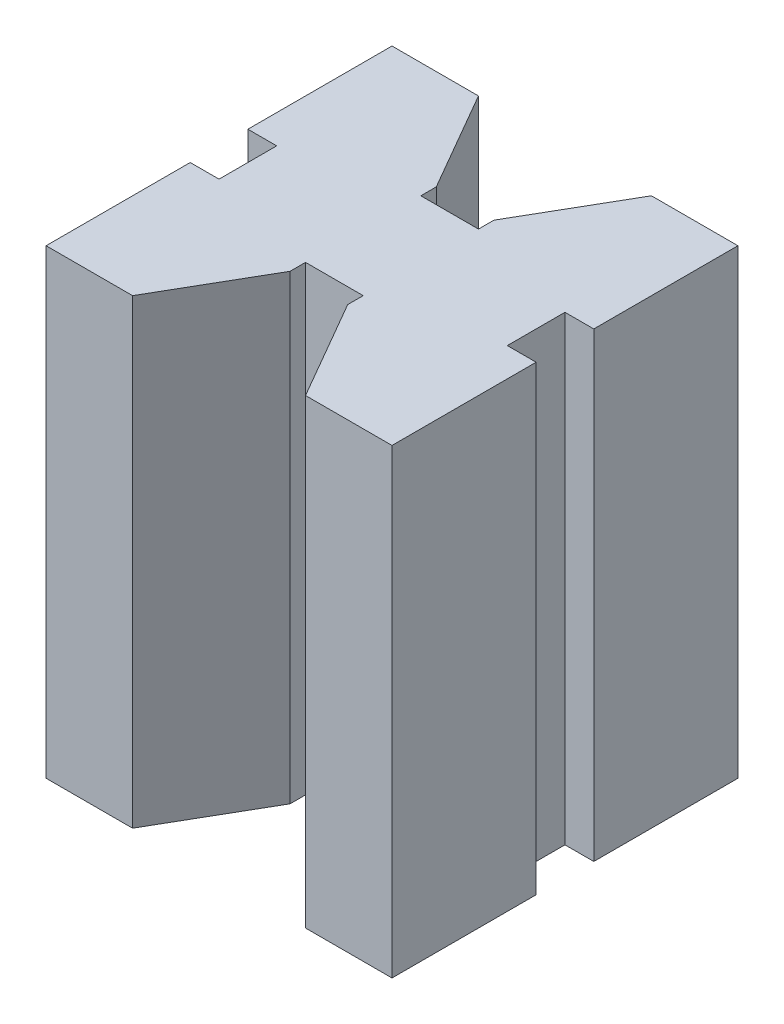
ISO-10303-21;
HEADER;
FILE_DESCRIPTION(('STEP AP214'),'2;1');
FILE_NAME('part.step','',(''),(''),'','','');
FILE_SCHEMA(('AUTOMOTIVE_DESIGN { 1 0 10303 214 1 1 1 1 }'));
ENDSEC;
DATA;
#1=APPLICATION_CONTEXT('core data for automotive mechanical design processes');
#2=APPLICATION_PROTOCOL_DEFINITION('international standard','automotive_design',2000,#1);
#3=PRODUCT_CONTEXT('',#1,'mechanical');
#4=PRODUCT('Part','Part','',(#3));
#5=PRODUCT_RELATED_PRODUCT_CATEGORY('part','',(#4));
#6=PRODUCT_DEFINITION_FORMATION('','',#4);
#7=PRODUCT_DEFINITION_CONTEXT('part definition',#1,'design');
#8=PRODUCT_DEFINITION('design','',#6,#7);
#9=PRODUCT_DEFINITION_SHAPE('','',#8);
#10=(LENGTH_UNIT() NAMED_UNIT(*) SI_UNIT(.MILLI.,.METRE.));
#11=(NAMED_UNIT(*) PLANE_ANGLE_UNIT() SI_UNIT($,.RADIAN.));
#12=(NAMED_UNIT(*) SI_UNIT($,.STERADIAN.) SOLID_ANGLE_UNIT());
#13=UNCERTAINTY_MEASURE_WITH_UNIT(LENGTH_MEASURE(1.E-05),#10,'distance_accuracy_value','');
#14=(GEOMETRIC_REPRESENTATION_CONTEXT(3) GLOBAL_UNCERTAINTY_ASSIGNED_CONTEXT((#13)) GLOBAL_UNIT_ASSIGNED_CONTEXT((#10,
#11,#12)) REPRESENTATION_CONTEXT('',''));
#15=CARTESIAN_POINT('',(0.,0.,0.));
#16=DIRECTION('',(0.,0.,1.));
#17=DIRECTION('',(1.,0.,0.));
#18=AXIS2_PLACEMENT_3D('',#15,#16,#17);
#19=CARTESIAN_POINT('',(0.,40.,0.));
#20=DIRECTION('',(-1.,0.,0.));
#21=DIRECTION('',(0.,0.,1.));
#22=AXIS2_PLACEMENT_3D('',#19,#20,#21);
#23=PLANE('',#22);
#24=DIRECTION('',(0.,0.,-1.));
#25=VECTOR('',#24,1.);
#26=CARTESIAN_POINT('',(0.,0.,0.));
#27=LINE('',#26,#25);
#28=CARTESIAN_POINT('',(0.,0.,0.));
#29=VERTEX_POINT('',#28);
#30=CARTESIAN_POINT('',(0.,0.,-12.5));
#31=VERTEX_POINT('',#30);
#32=EDGE_CURVE('E231',#29,#31,#27,.T.);
#33=ORIENTED_EDGE('',*,*,#32,.T.);
#34=DIRECTION('',(0.,-1.,0.));
#35=VECTOR('',#34,1.);
#36=CARTESIAN_POINT('',(0.,40.,-12.5));
#37=LINE('',#36,#35);
#38=CARTESIAN_POINT('',(0.,40.,-12.5));
#39=VERTEX_POINT('',#38);
#40=EDGE_CURVE('E11',#39,#31,#37,.T.);
#41=ORIENTED_EDGE('',*,*,#40,.F.);
#42=DIRECTION('',(0.,0.,-1.));
#43=VECTOR('',#42,1.);
#44=CARTESIAN_POINT('',(0.,40.,0.));
#45=LINE('',#44,#43);
#46=CARTESIAN_POINT('',(0.,40.,0.));
#47=VERTEX_POINT('',#46);
#48=EDGE_CURVE('E277',#47,#39,#45,.T.);
#49=ORIENTED_EDGE('',*,*,#48,.F.);
#50=DIRECTION('',(0.,-1.,0.));
#51=VECTOR('',#50,1.);
#52=CARTESIAN_POINT('',(0.,40.,0.));
#53=LINE('',#52,#51);
#54=EDGE_CURVE('E227',#47,#29,#53,.T.);
#55=ORIENTED_EDGE('',*,*,#54,.T.);
#56=EDGE_LOOP('',(#33,#41,#49,#55));
#57=FACE_BOUND('',#56,.T.);
#58=ADVANCED_FACE('F39',(#57),#23,.F.);
#59=CARTESIAN_POINT('',(-2.5,40.,-12.5));
#60=DIRECTION('',(0.,0.,1.));
#61=DIRECTION('',(1.,0.,0.));
#62=AXIS2_PLACEMENT_3D('',#59,#60,#61);
#63=PLANE('',#62);
#64=DIRECTION('',(-1.,0.,0.));
#65=VECTOR('',#64,1.);
#66=CARTESIAN_POINT('',(-2.5,0.,-12.5));
#67=LINE('',#66,#65);
#68=CARTESIAN_POINT('',(-2.5,0.,-12.5));
#69=VERTEX_POINT('',#68);
#70=EDGE_CURVE('E234',#31,#69,#67,.T.);
#71=ORIENTED_EDGE('',*,*,#70,.T.);
#72=DIRECTION('',(0.,-1.,0.));
#73=VECTOR('',#72,1.);
#74=CARTESIAN_POINT('',(-2.5,40.,-12.5));
#75=LINE('',#74,#73);
#76=CARTESIAN_POINT('',(-2.5,40.,-12.5));
#77=VERTEX_POINT('',#76);
#78=EDGE_CURVE('E47',#77,#69,#75,.T.);
#79=ORIENTED_EDGE('',*,*,#78,.F.);
#80=DIRECTION('',(-1.,0.,0.));
#81=VECTOR('',#80,1.);
#82=CARTESIAN_POINT('',(-2.5,40.,-12.5));
#83=LINE('',#82,#81);
#84=EDGE_CURVE('E146',#39,#77,#83,.T.);
#85=ORIENTED_EDGE('',*,*,#84,.F.);
#86=ORIENTED_EDGE('',*,*,#40,.T.);
#87=EDGE_LOOP('',(#71,#79,#85,#86));
#88=FACE_BOUND('',#87,.T.);
#89=ADVANCED_FACE('F415',(#88),#63,.F.);
#90=CARTESIAN_POINT('',(-2.5,40.,-17.5));
#91=DIRECTION('',(-1.,0.,0.));
#92=DIRECTION('',(0.,0.,1.));
#93=AXIS2_PLACEMENT_3D('',#90,#91,#92);
#94=PLANE('',#93);
#95=DIRECTION('',(0.,0.,-1.));
#96=VECTOR('',#95,1.);
#97=CARTESIAN_POINT('',(-2.5,0.,-17.5));
#98=LINE('',#97,#96);
#99=CARTESIAN_POINT('',(-2.5,0.,-17.5));
#100=VERTEX_POINT('',#99);
#101=EDGE_CURVE('E236',#69,#100,#98,.T.);
#102=ORIENTED_EDGE('',*,*,#101,.T.);
#103=DIRECTION('',(0.,-1.,0.));
#104=VECTOR('',#103,1.);
#105=CARTESIAN_POINT('',(-2.5,40.,-17.5));
#106=LINE('',#105,#104);
#107=CARTESIAN_POINT('',(-2.5,40.,-17.5));
#108=VERTEX_POINT('',#107);
#109=EDGE_CURVE('E332',#108,#100,#106,.T.);
#110=ORIENTED_EDGE('',*,*,#109,.F.);
#111=DIRECTION('',(0.,0.,-1.));
#112=VECTOR('',#111,1.);
#113=CARTESIAN_POINT('',(-2.5,40.,-17.5));
#114=LINE('',#113,#112);
#115=EDGE_CURVE('E340',#77,#108,#114,.T.);
#116=ORIENTED_EDGE('',*,*,#115,.F.);
#117=ORIENTED_EDGE('',*,*,#78,.T.);
#118=EDGE_LOOP('',(#102,#110,#116,#117));
#119=FACE_BOUND('',#118,.T.);
#120=ADVANCED_FACE('F338',(#119),#94,.F.);
#121=CARTESIAN_POINT('',(0.,40.,-17.5));
#122=DIRECTION('',(0.,0.,-1.));
#123=DIRECTION('',(-1.,0.,0.));
#124=AXIS2_PLACEMENT_3D('',#121,#122,#123);
#125=PLANE('',#124);
#126=DIRECTION('',(1.,0.,0.));
#127=VECTOR('',#126,1.);
#128=CARTESIAN_POINT('',(0.,0.,-17.5));
#129=LINE('',#128,#127);
#130=CARTESIAN_POINT('',(0.,0.,-17.5));
#131=VERTEX_POINT('',#130);
#132=EDGE_CURVE('E238',#100,#131,#129,.T.);
#133=ORIENTED_EDGE('',*,*,#132,.T.);
#134=DIRECTION('',(0.,-1.,0.));
#135=VECTOR('',#134,1.);
#136=CARTESIAN_POINT('',(0.,40.,-17.5));
#137=LINE('',#136,#135);
#138=CARTESIAN_POINT('',(0.,40.,-17.5));
#139=VERTEX_POINT('',#138);
#140=EDGE_CURVE('E329',#139,#131,#137,.T.);
#141=ORIENTED_EDGE('',*,*,#140,.F.);
#142=DIRECTION('',(1.,0.,0.));
#143=VECTOR('',#142,1.);
#144=CARTESIAN_POINT('',(0.,40.,-17.5));
#145=LINE('',#144,#143);
#146=EDGE_CURVE('E358',#108,#139,#145,.T.);
#147=ORIENTED_EDGE('',*,*,#146,.F.);
#148=ORIENTED_EDGE('',*,*,#109,.T.);
#149=EDGE_LOOP('',(#133,#141,#147,#148));
#150=FACE_BOUND('',#149,.T.);
#151=ADVANCED_FACE('F349',(#150),#125,.F.);
#152=CARTESIAN_POINT('',(0.,40.,-17.5));
#153=DIRECTION('',(-1.,0.,0.));
#154=DIRECTION('',(0.,0.,1.));
#155=AXIS2_PLACEMENT_3D('',#152,#153,#154);
#156=PLANE('',#155);
#157=DIRECTION('',(0.,0.,-1.));
#158=VECTOR('',#157,1.);
#159=CARTESIAN_POINT('',(0.,0.,-17.5));
#160=LINE('',#159,#158);
#161=CARTESIAN_POINT('',(0.,0.,-30.));
#162=VERTEX_POINT('',#161);
#163=EDGE_CURVE('E240',#131,#162,#160,.T.);
#164=ORIENTED_EDGE('',*,*,#163,.T.);
#165=DIRECTION('',(0.,-1.,0.));
#166=VECTOR('',#165,1.);
#167=CARTESIAN_POINT('',(0.,40.,-30.));
#168=LINE('',#167,#166);
#169=CARTESIAN_POINT('',(0.,40.,-30.));
#170=VERTEX_POINT('',#169);
#171=EDGE_CURVE('E326',#170,#162,#168,.T.);
#172=ORIENTED_EDGE('',*,*,#171,.F.);
#173=DIRECTION('',(0.,0.,-1.));
#174=VECTOR('',#173,1.);
#175=CARTESIAN_POINT('',(0.,40.,-17.5));
#176=LINE('',#175,#174);
#177=EDGE_CURVE('E355',#139,#170,#176,.T.);
#178=ORIENTED_EDGE('',*,*,#177,.F.);
#179=ORIENTED_EDGE('',*,*,#140,.T.);
#180=EDGE_LOOP('',(#164,#172,#178,#179));
#181=FACE_BOUND('',#180,.T.);
#182=ADVANCED_FACE('F353',(#181),#156,.F.);
#183=CARTESIAN_POINT('',(0.,40.,-30.));
#184=DIRECTION('',(0.,0.,1.));
#185=DIRECTION('',(1.,0.,0.));
#186=AXIS2_PLACEMENT_3D('',#183,#184,#185);
#187=PLANE('',#186);
#188=DIRECTION('',(-1.,0.,0.));
#189=VECTOR('',#188,1.);
#190=CARTESIAN_POINT('',(0.,0.,-30.));
#191=LINE('',#190,#189);
#192=CARTESIAN_POINT('',(-7.5,0.,-30.));
#193=VERTEX_POINT('',#192);
#194=EDGE_CURVE('E242',#162,#193,#191,.T.);
#195=ORIENTED_EDGE('',*,*,#194,.T.);
#196=DIRECTION('',(0.,-1.,0.));
#197=VECTOR('',#196,1.);
#198=CARTESIAN_POINT('',(-7.5,40.,-30.));
#199=LINE('',#198,#197);
#200=CARTESIAN_POINT('',(-7.5,40.,-30.));
#201=VERTEX_POINT('',#200);
#202=EDGE_CURVE('E323',#201,#193,#199,.T.);
#203=ORIENTED_EDGE('',*,*,#202,.F.);
#204=DIRECTION('',(-1.,0.,0.));
#205=VECTOR('',#204,1.);
#206=CARTESIAN_POINT('',(0.,40.,-30.));
#207=LINE('',#206,#205);
#208=EDGE_CURVE('E357',#170,#201,#207,.T.);
#209=ORIENTED_EDGE('',*,*,#208,.F.);
#210=ORIENTED_EDGE('',*,*,#171,.T.);
#211=EDGE_LOOP('',(#195,#203,#209,#210));
#212=FACE_BOUND('',#211,.T.);
#213=ADVANCED_FACE('F428',(#212),#187,.F.);
#214=CARTESIAN_POINT('',(-12.5,40.,-21.3397459621557));
#215=DIRECTION('',(0.866025403784436,0.,0.500000000000004));
#216=DIRECTION('',(0.500000000000004,0.,-0.866025403784437));
#217=AXIS2_PLACEMENT_3D('',#214,#215,#216);
#218=PLANE('',#217);
#219=DIRECTION('',(-0.500000000000004,0.,0.866025403784436));
#220=VECTOR('',#219,1.);
#221=CARTESIAN_POINT('',(-12.5,0.,-21.3397459621557));
#222=LINE('',#221,#220);
#223=CARTESIAN_POINT('',(-12.5,0.,-21.3397459621557));
#224=VERTEX_POINT('',#223);
#225=EDGE_CURVE('E244',#193,#224,#222,.T.);
#226=ORIENTED_EDGE('',*,*,#225,.T.);
#227=DIRECTION('',(0.,-1.,0.));
#228=VECTOR('',#227,1.);
#229=CARTESIAN_POINT('',(-12.5,40.,-21.3397459621557));
#230=LINE('',#229,#228);
#231=CARTESIAN_POINT('',(-12.5,40.,-21.3397459621557));
#232=VERTEX_POINT('',#231);
#233=EDGE_CURVE('E320',#232,#224,#230,.T.);
#234=ORIENTED_EDGE('',*,*,#233,.F.);
#235=DIRECTION('',(-0.500000000000004,0.,0.866025403784436));
#236=VECTOR('',#235,1.);
#237=CARTESIAN_POINT('',(-12.5,40.,-21.3397459621557));
#238=LINE('',#237,#236);
#239=EDGE_CURVE('E360',#201,#232,#238,.T.);
#240=ORIENTED_EDGE('',*,*,#239,.F.);
#241=ORIENTED_EDGE('',*,*,#202,.T.);
#242=EDGE_LOOP('',(#226,#234,#240,#241));
#243=FACE_BOUND('',#242,.T.);
#244=ADVANCED_FACE('F431',(#243),#218,.F.);
#245=CARTESIAN_POINT('',(-12.5,40.,-20.));
#246=DIRECTION('',(1.,0.,0.));
#247=DIRECTION('',(0.,0.,-1.));
#248=AXIS2_PLACEMENT_3D('',#245,#246,#247);
#249=PLANE('',#248);
#250=DIRECTION('',(0.,0.,1.));
#251=VECTOR('',#250,1.);
#252=CARTESIAN_POINT('',(-12.5,0.,-20.));
#253=LINE('',#252,#251);
#254=CARTESIAN_POINT('',(-12.5,0.,-20.));
#255=VERTEX_POINT('',#254);
#256=EDGE_CURVE('E246',#224,#255,#253,.T.);
#257=ORIENTED_EDGE('',*,*,#256,.T.);
#258=DIRECTION('',(0.,-1.,0.));
#259=VECTOR('',#258,1.);
#260=CARTESIAN_POINT('',(-12.5,40.,-20.));
#261=LINE('',#260,#259);
#262=CARTESIAN_POINT('',(-12.5,40.,-20.));
#263=VERTEX_POINT('',#262);
#264=EDGE_CURVE('E317',#263,#255,#261,.T.);
#265=ORIENTED_EDGE('',*,*,#264,.F.);
#266=DIRECTION('',(0.,0.,1.));
#267=VECTOR('',#266,1.);
#268=CARTESIAN_POINT('',(-12.5,40.,-20.));
#269=LINE('',#268,#267);
#270=EDGE_CURVE('E366',#232,#263,#269,.T.);
#271=ORIENTED_EDGE('',*,*,#270,.F.);
#272=ORIENTED_EDGE('',*,*,#233,.T.);
#273=EDGE_LOOP('',(#257,#265,#271,#272));
#274=FACE_BOUND('',#273,.T.);
#275=ADVANCED_FACE('F435',(#274),#249,.F.);
#276=CARTESIAN_POINT('',(-17.5,40.,-20.));
#277=DIRECTION('',(0.,0.,1.));
#278=DIRECTION('',(1.,0.,0.));
#279=AXIS2_PLACEMENT_3D('',#276,#277,#278);
#280=PLANE('',#279);
#281=DIRECTION('',(-1.,0.,0.));
#282=VECTOR('',#281,1.);
#283=CARTESIAN_POINT('',(-17.5,0.,-20.));
#284=LINE('',#283,#282);
#285=CARTESIAN_POINT('',(-17.5,0.,-20.));
#286=VERTEX_POINT('',#285);
#287=EDGE_CURVE('E248',#255,#286,#284,.T.);
#288=ORIENTED_EDGE('',*,*,#287,.T.);
#289=DIRECTION('',(0.,-1.,0.));
#290=VECTOR('',#289,1.);
#291=CARTESIAN_POINT('',(-17.5,40.,-20.));
#292=LINE('',#291,#290);
#293=CARTESIAN_POINT('',(-17.5,40.,-20.));
#294=VERTEX_POINT('',#293);
#295=EDGE_CURVE('E314',#294,#286,#292,.T.);
#296=ORIENTED_EDGE('',*,*,#295,.F.);
#297=DIRECTION('',(-1.,0.,0.));
#298=VECTOR('',#297,1.);
#299=CARTESIAN_POINT('',(-17.5,40.,-20.));
#300=LINE('',#299,#298);
#301=EDGE_CURVE('E368',#263,#294,#300,.T.);
#302=ORIENTED_EDGE('',*,*,#301,.F.);
#303=ORIENTED_EDGE('',*,*,#264,.T.);
#304=EDGE_LOOP('',(#288,#296,#302,#303));
#305=FACE_BOUND('',#304,.T.);
#306=ADVANCED_FACE('F439',(#305),#280,.F.);
#307=CARTESIAN_POINT('',(-17.5,40.,-21.3397459621557));
#308=DIRECTION('',(-1.,0.,0.));
#309=DIRECTION('',(0.,0.,1.));
#310=AXIS2_PLACEMENT_3D('',#307,#308,#309);
#311=PLANE('',#310);
#312=DIRECTION('',(0.,0.,-1.));
#313=VECTOR('',#312,1.);
#314=CARTESIAN_POINT('',(-17.5,0.,-21.3397459621557));
#315=LINE('',#314,#313);
#316=CARTESIAN_POINT('',(-17.5,0.,-21.3397459621557));
#317=VERTEX_POINT('',#316);
#318=EDGE_CURVE('E250',#286,#317,#315,.T.);
#319=ORIENTED_EDGE('',*,*,#318,.T.);
#320=DIRECTION('',(0.,-1.,0.));
#321=VECTOR('',#320,1.);
#322=CARTESIAN_POINT('',(-17.5,40.,-21.3397459621557));
#323=LINE('',#322,#321);
#324=CARTESIAN_POINT('',(-17.5,40.,-21.3397459621557));
#325=VERTEX_POINT('',#324);
#326=EDGE_CURVE('E311',#325,#317,#323,.T.);
#327=ORIENTED_EDGE('',*,*,#326,.F.);
#328=DIRECTION('',(0.,0.,-1.));
#329=VECTOR('',#328,1.);
#330=CARTESIAN_POINT('',(-17.5,40.,-21.3397459621557));
#331=LINE('',#330,#329);
#332=EDGE_CURVE('E370',#294,#325,#331,.T.);
#333=ORIENTED_EDGE('',*,*,#332,.F.);
#334=ORIENTED_EDGE('',*,*,#295,.T.);
#335=EDGE_LOOP('',(#319,#327,#333,#334));
#336=FACE_BOUND('',#335,.T.);
#337=ADVANCED_FACE('F443',(#336),#311,.F.);
#338=CARTESIAN_POINT('',(-22.5,40.,-30.));
#339=DIRECTION('',(-0.866025403784436,0.,0.500000000000004));
#340=DIRECTION('',(0.500000000000005,0.,0.866025403784436));
#341=AXIS2_PLACEMENT_3D('',#338,#339,#340);
#342=PLANE('',#341);
#343=DIRECTION('',(-0.500000000000004,0.,-0.866025403784436));
#344=VECTOR('',#343,1.);
#345=CARTESIAN_POINT('',(-22.5,0.,-30.));
#346=LINE('',#345,#344);
#347=CARTESIAN_POINT('',(-22.5,0.,-30.));
#348=VERTEX_POINT('',#347);
#349=EDGE_CURVE('E252',#317,#348,#346,.T.);
#350=ORIENTED_EDGE('',*,*,#349,.T.);
#351=DIRECTION('',(0.,-1.,0.));
#352=VECTOR('',#351,1.);
#353=CARTESIAN_POINT('',(-22.5,40.,-30.));
#354=LINE('',#353,#352);
#355=CARTESIAN_POINT('',(-22.5,40.,-30.));
#356=VERTEX_POINT('',#355);
#357=EDGE_CURVE('E308',#356,#348,#354,.T.);
#358=ORIENTED_EDGE('',*,*,#357,.F.);
#359=DIRECTION('',(-0.500000000000004,0.,-0.866025403784436));
#360=VECTOR('',#359,1.);
#361=CARTESIAN_POINT('',(-22.5,40.,-30.));
#362=LINE('',#361,#360);
#363=EDGE_CURVE('E372',#325,#356,#362,.T.);
#364=ORIENTED_EDGE('',*,*,#363,.F.);
#365=ORIENTED_EDGE('',*,*,#326,.T.);
#366=EDGE_LOOP('',(#350,#358,#364,#365));
#367=FACE_BOUND('',#366,.T.);
#368=ADVANCED_FACE('F447',(#367),#342,.F.);
#369=CARTESIAN_POINT('',(-22.5,40.,-30.));
#370=DIRECTION('',(0.,0.,1.));
#371=DIRECTION('',(1.,0.,0.));
#372=AXIS2_PLACEMENT_3D('',#369,#370,#371);
#373=PLANE('',#372);
#374=DIRECTION('',(-1.,0.,0.));
#375=VECTOR('',#374,1.);
#376=CARTESIAN_POINT('',(-22.5,0.,-30.));
#377=LINE('',#376,#375);
#378=CARTESIAN_POINT('',(-30.,0.,-30.));
#379=VERTEX_POINT('',#378);
#380=EDGE_CURVE('E254',#348,#379,#377,.T.);
#381=ORIENTED_EDGE('',*,*,#380,.T.);
#382=DIRECTION('',(0.,-1.,0.));
#383=VECTOR('',#382,1.);
#384=CARTESIAN_POINT('',(-30.,40.,-30.));
#385=LINE('',#384,#383);
#386=CARTESIAN_POINT('',(-30.,40.,-30.));
#387=VERTEX_POINT('',#386);
#388=EDGE_CURVE('E305',#387,#379,#385,.T.);
#389=ORIENTED_EDGE('',*,*,#388,.F.);
#390=DIRECTION('',(-1.,0.,0.));
#391=VECTOR('',#390,1.);
#392=CARTESIAN_POINT('',(-22.5,40.,-30.));
#393=LINE('',#392,#391);
#394=EDGE_CURVE('E374',#356,#387,#393,.T.);
#395=ORIENTED_EDGE('',*,*,#394,.F.);
#396=ORIENTED_EDGE('',*,*,#357,.T.);
#397=EDGE_LOOP('',(#381,#389,#395,#396));
#398=FACE_BOUND('',#397,.T.);
#399=ADVANCED_FACE('F451',(#398),#373,.F.);
#400=CARTESIAN_POINT('',(-30.,40.,-17.5));
#401=DIRECTION('',(1.,0.,0.));
#402=DIRECTION('',(0.,0.,-1.));
#403=AXIS2_PLACEMENT_3D('',#400,#401,#402);
#404=PLANE('',#403);
#405=DIRECTION('',(0.,0.,1.));
#406=VECTOR('',#405,1.);
#407=CARTESIAN_POINT('',(-30.,0.,-17.5));
#408=LINE('',#407,#406);
#409=CARTESIAN_POINT('',(-30.,0.,-17.5));
#410=VERTEX_POINT('',#409);
#411=EDGE_CURVE('E256',#379,#410,#408,.T.);
#412=ORIENTED_EDGE('',*,*,#411,.T.);
#413=DIRECTION('',(0.,-1.,0.));
#414=VECTOR('',#413,1.);
#415=CARTESIAN_POINT('',(-30.,40.,-17.5));
#416=LINE('',#415,#414);
#417=CARTESIAN_POINT('',(-30.,40.,-17.5));
#418=VERTEX_POINT('',#417);
#419=EDGE_CURVE('E302',#418,#410,#416,.T.);
#420=ORIENTED_EDGE('',*,*,#419,.F.);
#421=DIRECTION('',(0.,0.,1.));
#422=VECTOR('',#421,1.);
#423=CARTESIAN_POINT('',(-30.,40.,-17.5));
#424=LINE('',#423,#422);
#425=EDGE_CURVE('E376',#387,#418,#424,.T.);
#426=ORIENTED_EDGE('',*,*,#425,.F.);
#427=ORIENTED_EDGE('',*,*,#388,.T.);
#428=EDGE_LOOP('',(#412,#420,#426,#427));
#429=FACE_BOUND('',#428,.T.);
#430=ADVANCED_FACE('F455',(#429),#404,.F.);
#431=CARTESIAN_POINT('',(-30.,40.,-17.5));
#432=DIRECTION('',(0.,0.,-1.));
#433=DIRECTION('',(-1.,0.,0.));
#434=AXIS2_PLACEMENT_3D('',#431,#432,#433);
#435=PLANE('',#434);
#436=DIRECTION('',(1.,0.,0.));
#437=VECTOR('',#436,1.);
#438=CARTESIAN_POINT('',(-30.,0.,-17.5));
#439=LINE('',#438,#437);
#440=CARTESIAN_POINT('',(-27.5,0.,-17.5));
#441=VERTEX_POINT('',#440);
#442=EDGE_CURVE('E258',#410,#441,#439,.T.);
#443=ORIENTED_EDGE('',*,*,#442,.T.);
#444=DIRECTION('',(0.,-1.,0.));
#445=VECTOR('',#444,1.);
#446=CARTESIAN_POINT('',(-27.5,40.,-17.5));
#447=LINE('',#446,#445);
#448=CARTESIAN_POINT('',(-27.5,40.,-17.5));
#449=VERTEX_POINT('',#448);
#450=EDGE_CURVE('E299',#449,#441,#447,.T.);
#451=ORIENTED_EDGE('',*,*,#450,.F.);
#452=DIRECTION('',(1.,0.,0.));
#453=VECTOR('',#452,1.);
#454=CARTESIAN_POINT('',(-30.,40.,-17.5));
#455=LINE('',#454,#453);
#456=EDGE_CURVE('E378',#418,#449,#455,.T.);
#457=ORIENTED_EDGE('',*,*,#456,.F.);
#458=ORIENTED_EDGE('',*,*,#419,.T.);
#459=EDGE_LOOP('',(#443,#451,#457,#458));
#460=FACE_BOUND('',#459,.T.);
#461=ADVANCED_FACE('F459',(#460),#435,.F.);
#462=CARTESIAN_POINT('',(-27.5,40.,-17.5));
#463=DIRECTION('',(1.,0.,0.));
#464=DIRECTION('',(0.,0.,-1.));
#465=AXIS2_PLACEMENT_3D('',#462,#463,#464);
#466=PLANE('',#465);
#467=DIRECTION('',(0.,0.,1.));
#468=VECTOR('',#467,1.);
#469=CARTESIAN_POINT('',(-27.5,0.,-17.5));
#470=LINE('',#469,#468);
#471=CARTESIAN_POINT('',(-27.5,0.,-12.5));
#472=VERTEX_POINT('',#471);
#473=EDGE_CURVE('E260',#441,#472,#470,.T.);
#474=ORIENTED_EDGE('',*,*,#473,.T.);
#475=DIRECTION('',(0.,-1.,0.));
#476=VECTOR('',#475,1.);
#477=CARTESIAN_POINT('',(-27.5,40.,-12.5));
#478=LINE('',#477,#476);
#479=CARTESIAN_POINT('',(-27.5,40.,-12.5));
#480=VERTEX_POINT('',#479);
#481=EDGE_CURVE('E296',#480,#472,#478,.T.);
#482=ORIENTED_EDGE('',*,*,#481,.F.);
#483=DIRECTION('',(0.,0.,1.));
#484=VECTOR('',#483,1.);
#485=CARTESIAN_POINT('',(-27.5,40.,-17.5));
#486=LINE('',#485,#484);
#487=EDGE_CURVE('E380',#449,#480,#486,.T.);
#488=ORIENTED_EDGE('',*,*,#487,.F.);
#489=ORIENTED_EDGE('',*,*,#450,.T.);
#490=EDGE_LOOP('',(#474,#482,#488,#489));
#491=FACE_BOUND('',#490,.T.);
#492=ADVANCED_FACE('F463',(#491),#466,.F.);
#493=CARTESIAN_POINT('',(-27.5,40.,-12.5));
#494=DIRECTION('',(0.,0.,1.));
#495=DIRECTION('',(1.,0.,0.));
#496=AXIS2_PLACEMENT_3D('',#493,#494,#495);
#497=PLANE('',#496);
#498=DIRECTION('',(-1.,0.,0.));
#499=VECTOR('',#498,1.);
#500=CARTESIAN_POINT('',(-27.5,0.,-12.5));
#501=LINE('',#500,#499);
#502=CARTESIAN_POINT('',(-30.,0.,-12.5));
#503=VERTEX_POINT('',#502);
#504=EDGE_CURVE('E262',#472,#503,#501,.T.);
#505=ORIENTED_EDGE('',*,*,#504,.T.);
#506=DIRECTION('',(0.,-1.,0.));
#507=VECTOR('',#506,1.);
#508=CARTESIAN_POINT('',(-30.,40.,-12.5));
#509=LINE('',#508,#507);
#510=CARTESIAN_POINT('',(-30.,40.,-12.5));
#511=VERTEX_POINT('',#510);
#512=EDGE_CURVE('E293',#511,#503,#509,.T.);
#513=ORIENTED_EDGE('',*,*,#512,.F.);
#514=DIRECTION('',(-1.,0.,0.));
#515=VECTOR('',#514,1.);
#516=CARTESIAN_POINT('',(-27.5,40.,-12.5));
#517=LINE('',#516,#515);
#518=EDGE_CURVE('E382',#480,#511,#517,.T.);
#519=ORIENTED_EDGE('',*,*,#518,.F.);
#520=ORIENTED_EDGE('',*,*,#481,.T.);
#521=EDGE_LOOP('',(#505,#513,#519,#520));
#522=FACE_BOUND('',#521,.T.);
#523=ADVANCED_FACE('F467',(#522),#497,.F.);
#524=CARTESIAN_POINT('',(-30.,40.,0.));
#525=DIRECTION('',(1.,0.,0.));
#526=DIRECTION('',(0.,0.,-1.));
#527=AXIS2_PLACEMENT_3D('',#524,#525,#526);
#528=PLANE('',#527);
#529=DIRECTION('',(0.,0.,1.));
#530=VECTOR('',#529,1.);
#531=CARTESIAN_POINT('',(-30.,0.,0.));
#532=LINE('',#531,#530);
#533=CARTESIAN_POINT('',(-30.,0.,0.));
#534=VERTEX_POINT('',#533);
#535=EDGE_CURVE('E264',#503,#534,#532,.T.);
#536=ORIENTED_EDGE('',*,*,#535,.T.);
#537=DIRECTION('',(0.,-1.,0.));
#538=VECTOR('',#537,1.);
#539=CARTESIAN_POINT('',(-30.,40.,0.));
#540=LINE('',#539,#538);
#541=CARTESIAN_POINT('',(-30.,40.,0.));
#542=VERTEX_POINT('',#541);
#543=EDGE_CURVE('E290',#542,#534,#540,.T.);
#544=ORIENTED_EDGE('',*,*,#543,.F.);
#545=DIRECTION('',(0.,0.,1.));
#546=VECTOR('',#545,1.);
#547=CARTESIAN_POINT('',(-30.,40.,0.));
#548=LINE('',#547,#546);
#549=EDGE_CURVE('E384',#511,#542,#548,.T.);
#550=ORIENTED_EDGE('',*,*,#549,.F.);
#551=ORIENTED_EDGE('',*,*,#512,.T.);
#552=EDGE_LOOP('',(#536,#544,#550,#551));
#553=FACE_BOUND('',#552,.T.);
#554=ADVANCED_FACE('F471',(#553),#528,.F.);
#555=CARTESIAN_POINT('',(-22.5,40.,0.));
#556=DIRECTION('',(0.,0.,-1.));
#557=DIRECTION('',(-1.,0.,0.));
#558=AXIS2_PLACEMENT_3D('',#555,#556,#557);
#559=PLANE('',#558);
#560=DIRECTION('',(1.,0.,0.));
#561=VECTOR('',#560,1.);
#562=CARTESIAN_POINT('',(-22.5,0.,0.));
#563=LINE('',#562,#561);
#564=CARTESIAN_POINT('',(-22.5,0.,0.));
#565=VERTEX_POINT('',#564);
#566=EDGE_CURVE('E266',#534,#565,#563,.T.);
#567=ORIENTED_EDGE('',*,*,#566,.T.);
#568=DIRECTION('',(0.,-1.,0.));
#569=VECTOR('',#568,1.);
#570=CARTESIAN_POINT('',(-22.5,40.,0.));
#571=LINE('',#570,#569);
#572=CARTESIAN_POINT('',(-22.5,40.,0.));
#573=VERTEX_POINT('',#572);
#574=EDGE_CURVE('E287',#573,#565,#571,.T.);
#575=ORIENTED_EDGE('',*,*,#574,.F.);
#576=DIRECTION('',(1.,0.,0.));
#577=VECTOR('',#576,1.);
#578=CARTESIAN_POINT('',(-22.5,40.,0.));
#579=LINE('',#578,#577);
#580=EDGE_CURVE('E386',#542,#573,#579,.T.);
#581=ORIENTED_EDGE('',*,*,#580,.F.);
#582=ORIENTED_EDGE('',*,*,#543,.T.);
#583=EDGE_LOOP('',(#567,#575,#581,#582));
#584=FACE_BOUND('',#583,.T.);
#585=ADVANCED_FACE('F475',(#584),#559,.F.);
#586=CARTESIAN_POINT('',(-22.5,40.,0.));
#587=DIRECTION('',(-0.866025403784436,0.,-0.500000000000004));
#588=DIRECTION('',(-0.500000000000004,0.,0.866025403784436));
#589=AXIS2_PLACEMENT_3D('',#586,#587,#588);
#590=PLANE('',#589);
#591=DIRECTION('',(0.500000000000004,0.,-0.866025403784436));
#592=VECTOR('',#591,1.);
#593=CARTESIAN_POINT('',(-22.5,0.,0.));
#594=LINE('',#593,#592);
#595=CARTESIAN_POINT('',(-17.5,0.,-8.66025403784429));
#596=VERTEX_POINT('',#595);
#597=EDGE_CURVE('E268',#565,#596,#594,.T.);
#598=ORIENTED_EDGE('',*,*,#597,.T.);
#599=DIRECTION('',(0.,-1.,0.));
#600=VECTOR('',#599,1.);
#601=CARTESIAN_POINT('',(-17.5,40.,-8.66025403784429));
#602=LINE('',#601,#600);
#603=CARTESIAN_POINT('',(-17.5,40.,-8.66025403784429));
#604=VERTEX_POINT('',#603);
#605=EDGE_CURVE('E284',#604,#596,#602,.T.);
#606=ORIENTED_EDGE('',*,*,#605,.F.);
#607=DIRECTION('',(0.500000000000004,0.,-0.866025403784436));
#608=VECTOR('',#607,1.);
#609=CARTESIAN_POINT('',(-22.5,40.,0.));
#610=LINE('',#609,#608);
#611=EDGE_CURVE('E388',#573,#604,#610,.T.);
#612=ORIENTED_EDGE('',*,*,#611,.F.);
#613=ORIENTED_EDGE('',*,*,#574,.T.);
#614=EDGE_LOOP('',(#598,#606,#612,#613));
#615=FACE_BOUND('',#614,.T.);
#616=ADVANCED_FACE('F479',(#615),#590,.F.);
#617=CARTESIAN_POINT('',(-17.5,40.,-8.66025403784429));
#618=DIRECTION('',(-1.,0.,0.));
#619=DIRECTION('',(0.,0.,1.));
#620=AXIS2_PLACEMENT_3D('',#617,#618,#619);
#621=PLANE('',#620);
#622=DIRECTION('',(0.,0.,-1.));
#623=VECTOR('',#622,1.);
#624=CARTESIAN_POINT('',(-17.5,0.,-8.66025403784429));
#625=LINE('',#624,#623);
#626=CARTESIAN_POINT('',(-17.5,0.,-10.));
#627=VERTEX_POINT('',#626);
#628=EDGE_CURVE('E270',#596,#627,#625,.T.);
#629=ORIENTED_EDGE('',*,*,#628,.T.);
#630=DIRECTION('',(0.,-1.,0.));
#631=VECTOR('',#630,1.);
#632=CARTESIAN_POINT('',(-17.5,40.,-10.));
#633=LINE('',#632,#631);
#634=CARTESIAN_POINT('',(-17.5,40.,-10.));
#635=VERTEX_POINT('',#634);
#636=EDGE_CURVE('E281',#635,#627,#633,.T.);
#637=ORIENTED_EDGE('',*,*,#636,.F.);
#638=DIRECTION('',(0.,0.,-1.));
#639=VECTOR('',#638,1.);
#640=CARTESIAN_POINT('',(-17.5,40.,-8.66025403784429));
#641=LINE('',#640,#639);
#642=EDGE_CURVE('E390',#604,#635,#641,.T.);
#643=ORIENTED_EDGE('',*,*,#642,.F.);
#644=ORIENTED_EDGE('',*,*,#605,.T.);
#645=EDGE_LOOP('',(#629,#637,#643,#644));
#646=FACE_BOUND('',#645,.T.);
#647=ADVANCED_FACE('F396',(#646),#621,.F.);
#648=CARTESIAN_POINT('',(-17.5,40.,-10.));
#649=DIRECTION('',(0.,0.,-1.));
#650=DIRECTION('',(-1.,0.,0.));
#651=AXIS2_PLACEMENT_3D('',#648,#649,#650);
#652=PLANE('',#651);
#653=DIRECTION('',(1.,0.,0.));
#654=VECTOR('',#653,1.);
#655=CARTESIAN_POINT('',(-17.5,0.,-10.));
#656=LINE('',#655,#654);
#657=CARTESIAN_POINT('',(-12.5,0.,-10.));
#658=VERTEX_POINT('',#657);
#659=EDGE_CURVE('E272',#627,#658,#656,.T.);
#660=ORIENTED_EDGE('',*,*,#659,.T.);
#661=DIRECTION('',(0.,-1.,0.));
#662=VECTOR('',#661,1.);
#663=CARTESIAN_POINT('',(-12.5,40.,-10.));
#664=LINE('',#663,#662);
#665=CARTESIAN_POINT('',(-12.5,40.,-10.));
#666=VERTEX_POINT('',#665);
#667=EDGE_CURVE('E222',#666,#658,#664,.T.);
#668=ORIENTED_EDGE('',*,*,#667,.F.);
#669=DIRECTION('',(1.,0.,0.));
#670=VECTOR('',#669,1.);
#671=CARTESIAN_POINT('',(-17.5,40.,-10.));
#672=LINE('',#671,#670);
#673=EDGE_CURVE('E213',#635,#666,#672,.T.);
#674=ORIENTED_EDGE('',*,*,#673,.F.);
#675=ORIENTED_EDGE('',*,*,#636,.T.);
#676=EDGE_LOOP('',(#660,#668,#674,#675));
#677=FACE_BOUND('',#676,.T.);
#678=ADVANCED_FACE('F400',(#677),#652,.F.);
#679=CARTESIAN_POINT('',(-12.5,40.,-10.));
#680=DIRECTION('',(1.,0.,0.));
#681=DIRECTION('',(0.,0.,-1.));
#682=AXIS2_PLACEMENT_3D('',#679,#680,#681);
#683=PLANE('',#682);
#684=DIRECTION('',(0.,0.,1.));
#685=VECTOR('',#684,1.);
#686=CARTESIAN_POINT('',(-12.5,0.,-10.));
#687=LINE('',#686,#685);
#688=CARTESIAN_POINT('',(-12.5,0.,-8.66025403784429));
#689=VERTEX_POINT('',#688);
#690=EDGE_CURVE('E221',#658,#689,#687,.T.);
#691=ORIENTED_EDGE('',*,*,#690,.T.);
#692=DIRECTION('',(0.,-1.,0.));
#693=VECTOR('',#692,1.);
#694=CARTESIAN_POINT('',(-12.5,40.,-8.66025403784429));
#695=LINE('',#694,#693);
#696=CARTESIAN_POINT('',(-12.5,40.,-8.66025403784429));
#697=VERTEX_POINT('',#696);
#698=EDGE_CURVE('E218',#697,#689,#695,.T.);
#699=ORIENTED_EDGE('',*,*,#698,.F.);
#700=DIRECTION('',(0.,0.,1.));
#701=VECTOR('',#700,1.);
#702=CARTESIAN_POINT('',(-12.5,40.,-10.));
#703=LINE('',#702,#701);
#704=EDGE_CURVE('E207',#666,#697,#703,.T.);
#705=ORIENTED_EDGE('',*,*,#704,.F.);
#706=ORIENTED_EDGE('',*,*,#667,.T.);
#707=EDGE_LOOP('',(#691,#699,#705,#706));
#708=FACE_BOUND('',#707,.T.);
#709=ADVANCED_FACE('F219',(#708),#683,.F.);
#710=CARTESIAN_POINT('',(-12.5,40.,-8.66025403784429));
#711=DIRECTION('',(0.866025403784436,0.,-0.500000000000004));
#712=DIRECTION('',(-0.500000000000004,0.,-0.866025403784436));
#713=AXIS2_PLACEMENT_3D('',#710,#711,#712);
#714=PLANE('',#713);
#715=DIRECTION('',(0.500000000000004,0.,0.866025403784436));
#716=VECTOR('',#715,1.);
#717=CARTESIAN_POINT('',(-12.5,0.,-8.66025403784429));
#718=LINE('',#717,#716);
#719=CARTESIAN_POINT('',(-7.5,0.,0.));
#720=VERTEX_POINT('',#719);
#721=EDGE_CURVE('E132',#689,#720,#718,.T.);
#722=ORIENTED_EDGE('',*,*,#721,.T.);
#723=DIRECTION('',(0.,-1.,0.));
#724=VECTOR('',#723,1.);
#725=CARTESIAN_POINT('',(-7.5,40.,0.));
#726=LINE('',#725,#724);
#727=CARTESIAN_POINT('',(-7.5,40.,0.));
#728=VERTEX_POINT('',#727);
#729=EDGE_CURVE('E223',#728,#720,#726,.T.);
#730=ORIENTED_EDGE('',*,*,#729,.F.);
#731=DIRECTION('',(0.500000000000004,0.,0.866025403784436));
#732=VECTOR('',#731,1.);
#733=CARTESIAN_POINT('',(-12.5,40.,-8.66025403784429));
#734=LINE('',#733,#732);
#735=EDGE_CURVE('E211',#697,#728,#734,.T.);
#736=ORIENTED_EDGE('',*,*,#735,.F.);
#737=ORIENTED_EDGE('',*,*,#698,.T.);
#738=EDGE_LOOP('',(#722,#730,#736,#737));
#739=FACE_BOUND('',#738,.T.);
#740=ADVANCED_FACE('F225',(#739),#714,.F.);
#741=CARTESIAN_POINT('',(0.,40.,0.));
#742=DIRECTION('',(0.,0.,-1.));
#743=DIRECTION('',(-1.,0.,0.));
#744=AXIS2_PLACEMENT_3D('',#741,#742,#743);
#745=PLANE('',#744);
#746=DIRECTION('',(1.,0.,0.));
#747=VECTOR('',#746,1.);
#748=CARTESIAN_POINT('',(0.,0.,0.));
#749=LINE('',#748,#747);
#750=EDGE_CURVE('E138',#720,#29,#749,.T.);
#751=ORIENTED_EDGE('',*,*,#750,.T.);
#752=ORIENTED_EDGE('',*,*,#54,.F.);
#753=DIRECTION('',(1.,0.,0.));
#754=VECTOR('',#753,1.);
#755=CARTESIAN_POINT('',(0.,40.,0.));
#756=LINE('',#755,#754);
#757=EDGE_CURVE('E55',#728,#47,#756,.T.);
#758=ORIENTED_EDGE('',*,*,#757,.F.);
#759=ORIENTED_EDGE('',*,*,#729,.T.);
#760=EDGE_LOOP('',(#751,#752,#758,#759));
#761=FACE_BOUND('',#760,.T.);
#762=ADVANCED_FACE('F404',(#761),#745,.F.);
#763=CARTESIAN_POINT('',(0.,40.,0.));
#764=DIRECTION('',(0.,-1.,0.));
#765=DIRECTION('',(0.,0.,-1.));
#766=AXIS2_PLACEMENT_3D('',#763,#764,#765);
#767=PLANE('',#766);
#768=ORIENTED_EDGE('',*,*,#48,.T.);
#769=ORIENTED_EDGE('',*,*,#84,.T.);
#770=ORIENTED_EDGE('',*,*,#115,.T.);
#771=ORIENTED_EDGE('',*,*,#146,.T.);
#772=ORIENTED_EDGE('',*,*,#177,.T.);
#773=ORIENTED_EDGE('',*,*,#208,.T.);
#774=ORIENTED_EDGE('',*,*,#239,.T.);
#775=ORIENTED_EDGE('',*,*,#270,.T.);
#776=ORIENTED_EDGE('',*,*,#301,.T.);
#777=ORIENTED_EDGE('',*,*,#332,.T.);
#778=ORIENTED_EDGE('',*,*,#363,.T.);
#779=ORIENTED_EDGE('',*,*,#394,.T.);
#780=ORIENTED_EDGE('',*,*,#425,.T.);
#781=ORIENTED_EDGE('',*,*,#456,.T.);
#782=ORIENTED_EDGE('',*,*,#487,.T.);
#783=ORIENTED_EDGE('',*,*,#518,.T.);
#784=ORIENTED_EDGE('',*,*,#549,.T.);
#785=ORIENTED_EDGE('',*,*,#580,.T.);
#786=ORIENTED_EDGE('',*,*,#611,.T.);
#787=ORIENTED_EDGE('',*,*,#642,.T.);
#788=ORIENTED_EDGE('',*,*,#673,.T.);
#789=ORIENTED_EDGE('',*,*,#704,.T.);
#790=ORIENTED_EDGE('',*,*,#735,.T.);
#791=ORIENTED_EDGE('',*,*,#757,.T.);
#792=EDGE_LOOP('',(#768,#769,#770,#771,#772,#773,#774,#775,#776,#777,#778,#779,#780,#781,#782,
#783,#784,#785,#786,#787,#788,#789,#790,#791));
#793=FACE_BOUND('',#792,.T.);
#794=ADVANCED_FACE('F209',(#793),#767,.F.);
#795=CARTESIAN_POINT('',(0.,0.,0.));
#796=DIRECTION('',(0.,-1.,0.));
#797=DIRECTION('',(0.,0.,-1.));
#798=AXIS2_PLACEMENT_3D('',#795,#796,#797);
#799=PLANE('',#798);
#800=ORIENTED_EDGE('',*,*,#32,.F.);
#801=ORIENTED_EDGE('',*,*,#750,.F.);
#802=ORIENTED_EDGE('',*,*,#721,.F.);
#803=ORIENTED_EDGE('',*,*,#690,.F.);
#804=ORIENTED_EDGE('',*,*,#659,.F.);
#805=ORIENTED_EDGE('',*,*,#628,.F.);
#806=ORIENTED_EDGE('',*,*,#597,.F.);
#807=ORIENTED_EDGE('',*,*,#566,.F.);
#808=ORIENTED_EDGE('',*,*,#535,.F.);
#809=ORIENTED_EDGE('',*,*,#504,.F.);
#810=ORIENTED_EDGE('',*,*,#473,.F.);
#811=ORIENTED_EDGE('',*,*,#442,.F.);
#812=ORIENTED_EDGE('',*,*,#411,.F.);
#813=ORIENTED_EDGE('',*,*,#380,.F.);
#814=ORIENTED_EDGE('',*,*,#349,.F.);
#815=ORIENTED_EDGE('',*,*,#318,.F.);
#816=ORIENTED_EDGE('',*,*,#287,.F.);
#817=ORIENTED_EDGE('',*,*,#256,.F.);
#818=ORIENTED_EDGE('',*,*,#225,.F.);
#819=ORIENTED_EDGE('',*,*,#194,.F.);
#820=ORIENTED_EDGE('',*,*,#163,.F.);
#821=ORIENTED_EDGE('',*,*,#132,.F.);
#822=ORIENTED_EDGE('',*,*,#101,.F.);
#823=ORIENTED_EDGE('',*,*,#70,.F.);
#824=EDGE_LOOP('',(#800,#801,#802,#803,#804,#805,#806,#807,#808,#809,#810,#811,#812,#813,#814,
#815,#816,#817,#818,#819,#820,#821,#822,#823));
#825=FACE_BOUND('',#824,.T.);
#826=ADVANCED_FACE('F344',(#825),#799,.T.);
#827=CLOSED_SHELL('',(#58,#89,#120,#151,#182,#213,#244,#275,#306,#337,#368,#399,#430,#461,#492,
#523,#554,#585,#616,#647,#678,#709,#740,#762,#794,#826));
#828=MANIFOLD_SOLID_BREP('B2',#827);
#829=ADVANCED_BREP_SHAPE_REPRESENTATION('',(#18,#828),#14);
#830=SHAPE_DEFINITION_REPRESENTATION(#9,#829);
ENDSEC;
END-ISO-10303-21;
